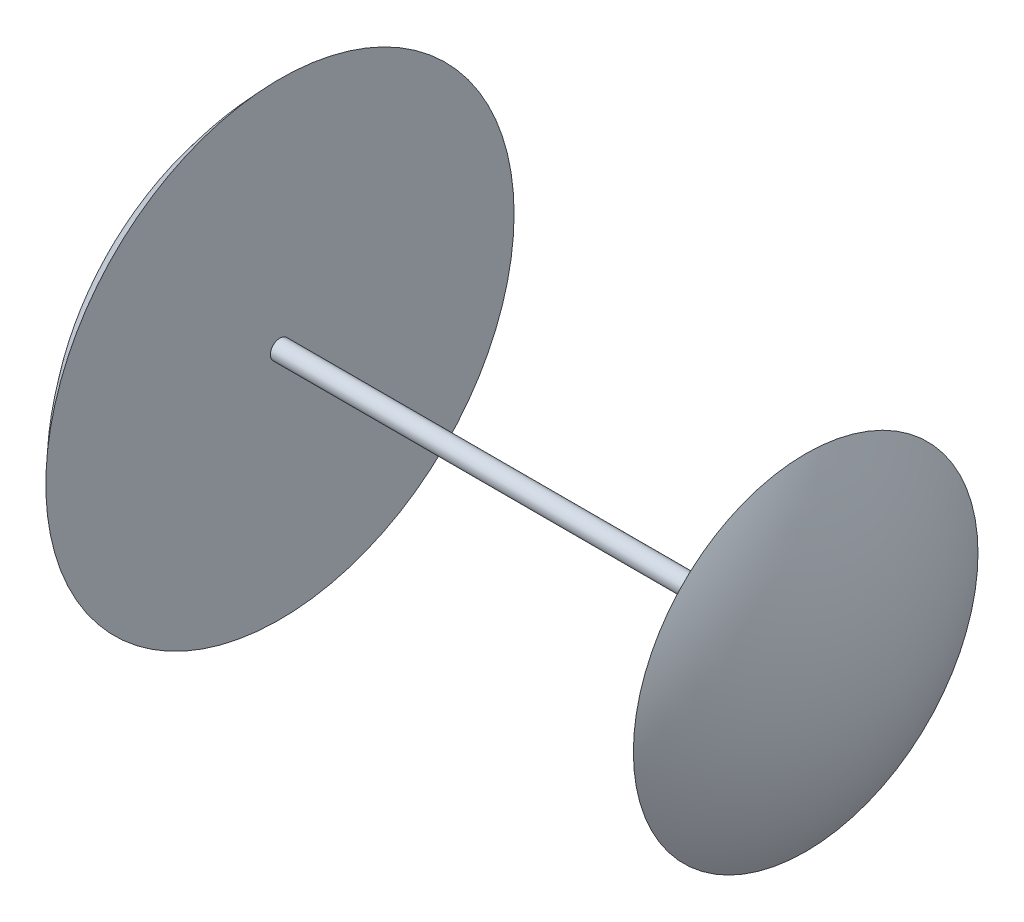
ISO-10303-21;
HEADER;
FILE_DESCRIPTION(('STEP AP214'),'2;1');
FILE_NAME('part.step','',(''),(''),'','','');
FILE_SCHEMA(('AUTOMOTIVE_DESIGN { 1 0 10303 214 1 1 1 1 }'));
ENDSEC;
DATA;
#1=APPLICATION_CONTEXT('core data for automotive mechanical design processes');
#2=APPLICATION_PROTOCOL_DEFINITION('international standard','automotive_design',2000,#1);
#3=PRODUCT_CONTEXT('',#1,'mechanical');
#4=PRODUCT('Part','Part','',(#3));
#5=PRODUCT_RELATED_PRODUCT_CATEGORY('part','',(#4));
#6=PRODUCT_DEFINITION_FORMATION('','',#4);
#7=PRODUCT_DEFINITION_CONTEXT('part definition',#1,'design');
#8=PRODUCT_DEFINITION('design','',#6,#7);
#9=PRODUCT_DEFINITION_SHAPE('','',#8);
#10=(LENGTH_UNIT() NAMED_UNIT(*) SI_UNIT(.MILLI.,.METRE.));
#11=(NAMED_UNIT(*) PLANE_ANGLE_UNIT() SI_UNIT($,.RADIAN.));
#12=(NAMED_UNIT(*) SI_UNIT($,.STERADIAN.) SOLID_ANGLE_UNIT());
#13=UNCERTAINTY_MEASURE_WITH_UNIT(LENGTH_MEASURE(1.E-05),#10,'distance_accuracy_value','');
#14=(GEOMETRIC_REPRESENTATION_CONTEXT(3) GLOBAL_UNCERTAINTY_ASSIGNED_CONTEXT((#13)) GLOBAL_UNIT_ASSIGNED_CONTEXT((#10,
#11,#12)) REPRESENTATION_CONTEXT('',''));
#15=CARTESIAN_POINT('',(0.,0.,0.));
#16=DIRECTION('',(0.,0.,1.));
#17=DIRECTION('',(1.,0.,0.));
#18=AXIS2_PLACEMENT_3D('',#15,#16,#17);
#19=CARTESIAN_POINT('',(60.,0.,0.));
#20=DIRECTION('',(1.,0.,0.));
#21=DIRECTION('',(0.,0.,-1.));
#22=AXIS2_PLACEMENT_3D('',#19,#20,#21);
#23=PLANE('',#22);
#24=CARTESIAN_POINT('',(60.0000000000023,0.,0.));
#25=DIRECTION('',(1.,0.,0.));
#26=DIRECTION('',(0.,0.,-1.));
#27=AXIS2_PLACEMENT_3D('',#24,#25,#26);
#28=CIRCLE('',#27,2.);
#29=CARTESIAN_POINT('',(60.0000000000023,0.,-2.));
#30=VERTEX_POINT('',#29);
#31=EDGE_CURVE('E11',#30,#30,#28,.F.);
#32=ORIENTED_EDGE('',*,*,#31,.F.);
#33=EDGE_LOOP('',(#32));
#34=FACE_BOUND('',#33,.T.);
#35=CARTESIAN_POINT('',(60.,0.,0.));
#36=DIRECTION('',(1.,0.,0.));
#37=DIRECTION('',(0.,0.,-1.));
#38=AXIS2_PLACEMENT_3D('',#35,#36,#37);
#39=CIRCLE('',#38,36.0555127546399);
#40=CARTESIAN_POINT('',(60.,0.,-36.0555127546399));
#41=VERTEX_POINT('',#40);
#42=EDGE_CURVE('E39',#41,#41,#39,.T.);
#43=ORIENTED_EDGE('',*,*,#42,.F.);
#44=EDGE_LOOP('',(#43));
#45=FACE_BOUND('',#44,.T.);
#46=ADVANCED_FACE('F32',(#34,#45),#23,.F.);
#47=CARTESIAN_POINT('',(0.,0.,0.));
#48=DIRECTION('',(0.,-1.,0.));
#49=DIRECTION('',(-1.,0.,0.));
#50=AXIS2_PLACEMENT_3D('',#47,#48,#49);
#51=SPHERICAL_SURFACE('',#50,70.);
#52=CARTESIAN_POINT('',(0.,0.,0.));
#53=DIRECTION('',(1.,0.,0.));
#54=DIRECTION('',(0.,0.,-1.));
#55=AXIS2_PLACEMENT_3D('',#52,#53,#54);
#56=SPHERICAL_SURFACE('',#55,70.);
#57=ORIENTED_EDGE('',*,*,#42,.T.);
#58=EDGE_LOOP('',(#57));
#59=FACE_BOUND('',#58,.T.);
#60=ADVANCED_FACE('F34',(#59),#56,.T.);
#61=CARTESIAN_POINT('',(-500000.,0.,0.));
#62=DIRECTION('',(1.,0.,0.));
#63=DIRECTION('',(0.,0.,-1.));
#64=AXIS2_PLACEMENT_3D('',#61,#62,#63);
#65=CYLINDRICAL_SURFACE('',#64,2.);
#66=CARTESIAN_POINT('',(-50.0000000000114,0.,0.));
#67=DIRECTION('',(1.,0.,0.));
#68=DIRECTION('',(0.,0.,-1.));
#69=AXIS2_PLACEMENT_3D('',#66,#67,#68);
#70=CIRCLE('',#69,2.);
#71=CARTESIAN_POINT('',(-50.0000000000114,0.,-2.));
#72=VERTEX_POINT('',#71);
#73=EDGE_CURVE('E43',#72,#72,#70,.T.);
#74=ORIENTED_EDGE('',*,*,#73,.T.);
#75=EDGE_LOOP('',(#74));
#76=FACE_BOUND('',#75,.T.);
#77=ORIENTED_EDGE('',*,*,#31,.T.);
#78=EDGE_LOOP('',(#77));
#79=FACE_BOUND('',#78,.T.);
#80=ADVANCED_FACE('F58',(#76,#79),#65,.T.);
#81=CARTESIAN_POINT('',(-50.,0.,0.));
#82=DIRECTION('',(1.,0.,0.));
#83=DIRECTION('',(0.,0.,-1.));
#84=AXIS2_PLACEMENT_3D('',#81,#82,#83);
#85=PLANE('',#84);
#86=ORIENTED_EDGE('',*,*,#73,.F.);
#87=EDGE_LOOP('',(#86));
#88=FACE_BOUND('',#87,.T.);
#89=CARTESIAN_POINT('',(-50.,0.,0.));
#90=DIRECTION('',(1.,0.,0.));
#91=DIRECTION('',(0.,0.,-1.));
#92=AXIS2_PLACEMENT_3D('',#89,#90,#91);
#93=CIRCLE('',#92,48.9897948556636);
#94=CARTESIAN_POINT('',(-50.,0.,-48.9897948556636));
#95=VERTEX_POINT('',#94);
#96=EDGE_CURVE('E47',#95,#95,#93,.T.);
#97=ORIENTED_EDGE('',*,*,#96,.T.);
#98=EDGE_LOOP('',(#97));
#99=FACE_BOUND('',#98,.T.);
#100=ADVANCED_FACE('F53',(#88,#99),#85,.T.);
#101=CARTESIAN_POINT('',(0.,0.,0.));
#102=DIRECTION('',(0.,-1.,0.));
#103=DIRECTION('',(-1.,0.,0.));
#104=AXIS2_PLACEMENT_3D('',#101,#102,#103);
#105=SPHERICAL_SURFACE('',#104,70.);
#106=CARTESIAN_POINT('',(0.,0.,0.));
#107=DIRECTION('',(1.,0.,0.));
#108=DIRECTION('',(0.,0.,-1.));
#109=AXIS2_PLACEMENT_3D('',#106,#107,#108);
#110=SPHERICAL_SURFACE('',#109,70.);
#111=ORIENTED_EDGE('',*,*,#96,.F.);
#112=EDGE_LOOP('',(#111));
#113=FACE_BOUND('',#112,.T.);
#114=ADVANCED_FACE('F55',(#113),#110,.T.);
#115=CLOSED_SHELL('',(#46,#60,#80,#100,#114));
#116=MANIFOLD_SOLID_BREP('B2',#115);
#117=ADVANCED_BREP_SHAPE_REPRESENTATION('',(#18,#116),#14);
#118=SHAPE_DEFINITION_REPRESENTATION(#9,#117);
ENDSEC;
END-ISO-10303-21;
